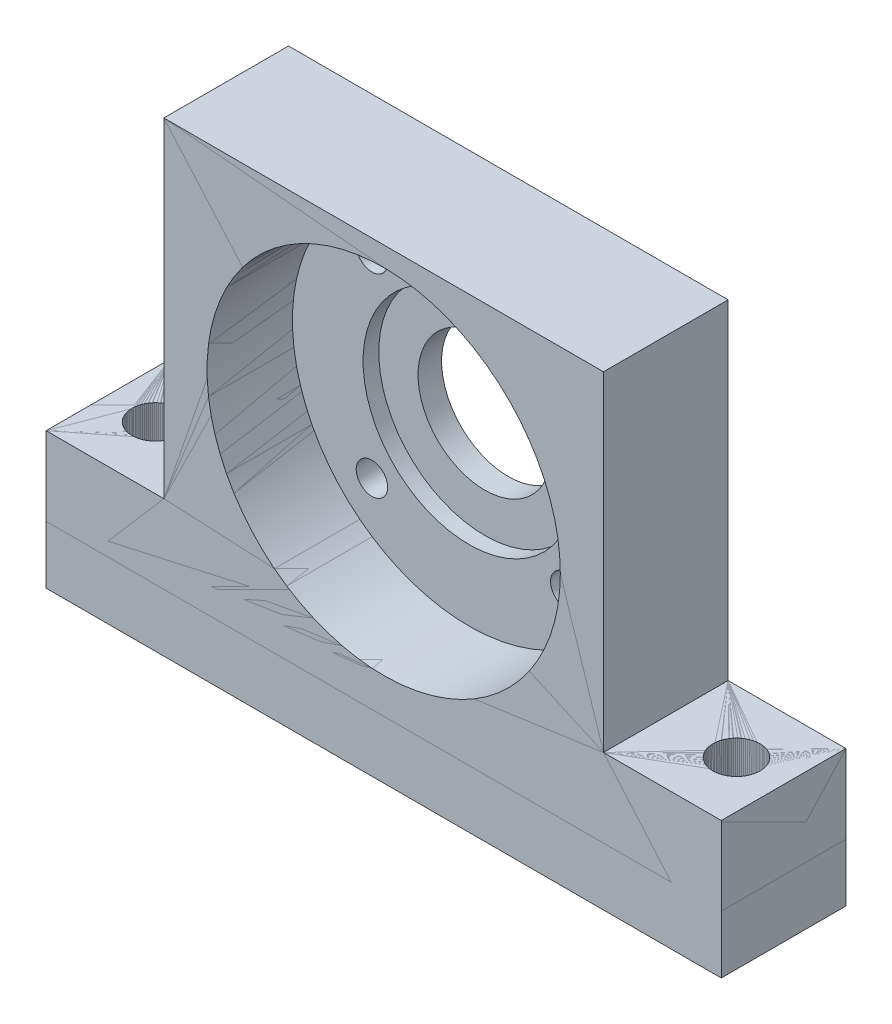
ISO-10303-21;
HEADER;
FILE_DESCRIPTION(('STEP AP214'),'2;1');
FILE_NAME('part.step','',(''),(''),'','','');
FILE_SCHEMA(('AUTOMOTIVE_DESIGN { 1 0 10303 214 1 1 1 1 }'));
ENDSEC;
DATA;
#1=APPLICATION_CONTEXT('core data for automotive mechanical design processes');
#2=APPLICATION_PROTOCOL_DEFINITION('international standard','automotive_design',2000,#1);
#3=PRODUCT_CONTEXT('',#1,'mechanical');
#4=PRODUCT('Part','Part','',(#3));
#5=PRODUCT_RELATED_PRODUCT_CATEGORY('part','',(#4));
#6=PRODUCT_DEFINITION_FORMATION('','',#4);
#7=PRODUCT_DEFINITION_CONTEXT('part definition',#1,'design');
#8=PRODUCT_DEFINITION('design','',#6,#7);
#9=PRODUCT_DEFINITION_SHAPE('','',#8);
#10=(LENGTH_UNIT() NAMED_UNIT(*) SI_UNIT(.MILLI.,.METRE.));
#11=(NAMED_UNIT(*) PLANE_ANGLE_UNIT() SI_UNIT($,.RADIAN.));
#12=(NAMED_UNIT(*) SI_UNIT($,.STERADIAN.) SOLID_ANGLE_UNIT());
#13=UNCERTAINTY_MEASURE_WITH_UNIT(LENGTH_MEASURE(1.E-05),#10,'distance_accuracy_value','');
#14=(GEOMETRIC_REPRESENTATION_CONTEXT(3) GLOBAL_UNCERTAINTY_ASSIGNED_CONTEXT((#13)) GLOBAL_UNIT_ASSIGNED_CONTEXT((#10,
#11,#12)) REPRESENTATION_CONTEXT('',''));
#15=CARTESIAN_POINT('',(0.,0.,0.));
#16=DIRECTION('',(0.,0.,1.));
#17=DIRECTION('',(1.,0.,0.));
#18=AXIS2_PLACEMENT_3D('',#15,#16,#17);
#19=CARTESIAN_POINT('',(0.,-5.56521739130435,0.));
#20=DIRECTION('',(0.,0.,1.));
#21=DIRECTION('',(1.,0.,0.));
#22=AXIS2_PLACEMENT_3D('',#19,#20,#21);
#23=PLANE('',#22);
#24=CARTESIAN_POINT('',(0.,0.,0.));
#25=DIRECTION('',(0.,0.,1.));
#26=DIRECTION('',(1.,0.,0.));
#27=AXIS2_PLACEMENT_3D('',#24,#25,#26);
#28=CIRCLE('',#27,22.5);
#29=CARTESIAN_POINT('',(22.5,0.,0.));
#30=VERTEX_POINT('',#29);
#31=EDGE_CURVE('P0_E173',#30,#30,#28,.T.);
#32=ORIENTED_EDGE('',*,*,#31,.T.);
#33=EDGE_LOOP('',(#32));
#34=FACE_BOUND('',#33,.T.);
#35=DIRECTION('',(0.,-1.,0.));
#36=VECTOR('',#35,1.);
#37=CARTESIAN_POINT('',(-28.,0.,0.));
#38=LINE('',#37,#36);
#39=CARTESIAN_POINT('',(-28.,25.,0.));
#40=VERTEX_POINT('',#39);
#41=CARTESIAN_POINT('',(-28.,-17.,0.));
#42=VERTEX_POINT('',#41);
#43=EDGE_CURVE('P0_E56',#40,#42,#38,.T.);
#44=ORIENTED_EDGE('',*,*,#43,.F.);
#45=DIRECTION('',(-1.,0.,0.));
#46=VECTOR('',#45,1.);
#47=CARTESIAN_POINT('',(28.,25.,0.));
#48=LINE('',#47,#46);
#49=CARTESIAN_POINT('',(28.,25.,0.));
#50=VERTEX_POINT('',#49);
#51=EDGE_CURVE('P0_E212',#50,#40,#48,.T.);
#52=ORIENTED_EDGE('',*,*,#51,.F.);
#53=DIRECTION('',(0.,1.,0.));
#54=VECTOR('',#53,1.);
#55=CARTESIAN_POINT('',(28.,-17.,0.));
#56=LINE('',#55,#54);
#57=CARTESIAN_POINT('',(28.,-17.,0.));
#58=VERTEX_POINT('',#57);
#59=EDGE_CURVE('P0_E208',#58,#50,#56,.T.);
#60=ORIENTED_EDGE('',*,*,#59,.F.);
#61=DIRECTION('',(-1.,0.,0.));
#62=VECTOR('',#61,1.);
#63=CARTESIAN_POINT('',(43.,-17.,0.));
#64=LINE('',#63,#62);
#65=CARTESIAN_POINT('',(43.,-17.,0.));
#66=VERTEX_POINT('',#65);
#67=EDGE_CURVE('P0_E182',#66,#58,#64,.T.);
#68=ORIENTED_EDGE('',*,*,#67,.F.);
#69=DIRECTION('',(0.,1.,0.));
#70=VECTOR('',#69,1.);
#71=CARTESIAN_POINT('',(43.,-27.,0.));
#72=LINE('',#71,#70);
#73=CARTESIAN_POINT('',(43.,-34.375,0.));
#74=VERTEX_POINT('',#73);
#75=EDGE_CURVE('P0_E149',#74,#66,#72,.T.);
#76=ORIENTED_EDGE('',*,*,#75,.F.);
#77=DIRECTION('',(1.,0.,0.));
#78=VECTOR('',#77,1.);
#79=CARTESIAN_POINT('',(-43.,-34.375,0.));
#80=LINE('',#79,#78);
#81=CARTESIAN_POINT('',(-43.,-34.375,0.));
#82=VERTEX_POINT('',#81);
#83=EDGE_CURVE('P0_E147',#82,#74,#80,.T.);
#84=ORIENTED_EDGE('',*,*,#83,.F.);
#85=DIRECTION('',(0.,-1.,0.));
#86=VECTOR('',#85,1.);
#87=CARTESIAN_POINT('',(-43.,-17.,0.));
#88=LINE('',#87,#86);
#89=CARTESIAN_POINT('',(-43.,-17.,0.));
#90=VERTEX_POINT('',#89);
#91=EDGE_CURVE('P0_E135',#90,#82,#88,.T.);
#92=ORIENTED_EDGE('',*,*,#91,.F.);
#93=DIRECTION('',(-1.,0.,0.));
#94=VECTOR('',#93,1.);
#95=CARTESIAN_POINT('',(-28.,-17.,0.));
#96=LINE('',#95,#94);
#97=EDGE_CURVE('P0_E95',#42,#90,#96,.T.);
#98=ORIENTED_EDGE('',*,*,#97,.F.);
#99=EDGE_LOOP('',(#44,#52,#60,#68,#76,#84,#92,#98));
#100=FACE_BOUND('',#99,.T.);
#101=ADVANCED_FACE('P0_F45',(#34,#100),#23,.F.);
#102=CARTESIAN_POINT('',(0.,-5.56521739130435,15.875));
#103=DIRECTION('',(0.,0.,1.));
#104=DIRECTION('',(1.,0.,0.));
#105=AXIS2_PLACEMENT_3D('',#102,#103,#104);
#106=PLANE('',#105);
#107=DIRECTION('',(0.,-1.,0.));
#108=VECTOR('',#107,1.);
#109=CARTESIAN_POINT('',(-28.,25.,15.875));
#110=LINE('',#109,#108);
#111=CARTESIAN_POINT('',(-28.,25.,15.875));
#112=VERTEX_POINT('',#111);
#113=CARTESIAN_POINT('',(-28.,-17.,15.875));
#114=VERTEX_POINT('',#113);
#115=EDGE_CURVE('P0_E11',#112,#114,#110,.T.);
#116=ORIENTED_EDGE('',*,*,#115,.T.);
#117=DIRECTION('',(-1.,0.,0.));
#118=VECTOR('',#117,1.);
#119=CARTESIAN_POINT('',(-28.,-17.,15.875));
#120=LINE('',#119,#118);
#121=CARTESIAN_POINT('',(-43.,-17.,15.875));
#122=VERTEX_POINT('',#121);
#123=EDGE_CURVE('P0_E189',#114,#122,#120,.T.);
#124=ORIENTED_EDGE('',*,*,#123,.T.);
#125=DIRECTION('',(0.,-1.,0.));
#126=VECTOR('',#125,1.);
#127=CARTESIAN_POINT('',(-43.,-17.,15.875));
#128=LINE('',#127,#126);
#129=CARTESIAN_POINT('',(-43.,-34.375,15.875));
#130=VERTEX_POINT('',#129);
#131=EDGE_CURVE('P0_E144',#122,#130,#128,.T.);
#132=ORIENTED_EDGE('',*,*,#131,.T.);
#133=DIRECTION('',(-1.,0.,0.));
#134=VECTOR('',#133,1.);
#135=CARTESIAN_POINT('',(43.,-34.375,15.875));
#136=LINE('',#135,#134);
#137=CARTESIAN_POINT('',(43.,-34.375,15.875));
#138=VERTEX_POINT('',#137);
#139=EDGE_CURVE('P0_E159',#138,#130,#136,.T.);
#140=ORIENTED_EDGE('',*,*,#139,.F.);
#141=DIRECTION('',(0.,1.,0.));
#142=VECTOR('',#141,1.);
#143=CARTESIAN_POINT('',(43.,-27.,15.875));
#144=LINE('',#143,#142);
#145=CARTESIAN_POINT('',(43.,-17.,15.875));
#146=VERTEX_POINT('',#145);
#147=EDGE_CURVE('P0_E101',#138,#146,#144,.T.);
#148=ORIENTED_EDGE('',*,*,#147,.T.);
#149=DIRECTION('',(-1.,0.,0.));
#150=VECTOR('',#149,1.);
#151=CARTESIAN_POINT('',(43.,-17.,15.875));
#152=LINE('',#151,#150);
#153=CARTESIAN_POINT('',(28.,-17.,15.875));
#154=VERTEX_POINT('',#153);
#155=EDGE_CURVE('P0_E185',#146,#154,#152,.T.);
#156=ORIENTED_EDGE('',*,*,#155,.T.);
#157=DIRECTION('',(0.,1.,0.));
#158=VECTOR('',#157,1.);
#159=CARTESIAN_POINT('',(28.,-17.,15.875));
#160=LINE('',#159,#158);
#161=CARTESIAN_POINT('',(28.,25.,15.875));
#162=VERTEX_POINT('',#161);
#163=EDGE_CURVE('P0_E215',#154,#162,#160,.T.);
#164=ORIENTED_EDGE('',*,*,#163,.T.);
#165=DIRECTION('',(-1.,0.,0.));
#166=VECTOR('',#165,1.);
#167=CARTESIAN_POINT('',(28.,25.,15.875));
#168=LINE('',#167,#166);
#169=EDGE_CURVE('P0_E200',#162,#112,#168,.T.);
#170=ORIENTED_EDGE('',*,*,#169,.T.);
#171=EDGE_LOOP('',(#116,#124,#132,#140,#148,#156,#164,#170));
#172=FACE_BOUND('',#171,.T.);
#173=CARTESIAN_POINT('',(0.,0.,15.875));
#174=DIRECTION('',(0.,0.,1.));
#175=DIRECTION('',(1.,0.,0.));
#176=AXIS2_PLACEMENT_3D('',#173,#174,#175);
#177=CIRCLE('',#176,22.5);
#178=CARTESIAN_POINT('',(22.5,0.,15.875));
#179=VERTEX_POINT('',#178);
#180=EDGE_CURVE('P0_E177',#179,#179,#177,.T.);
#181=ORIENTED_EDGE('',*,*,#180,.F.);
#182=EDGE_LOOP('',(#181));
#183=FACE_BOUND('',#182,.T.);
#184=ADVANCED_FACE('P0_F258',(#172,#183),#106,.T.);
#185=CARTESIAN_POINT('',(-28.,0.,0.));
#186=DIRECTION('',(-1.,0.,0.));
#187=DIRECTION('',(0.,0.,1.));
#188=AXIS2_PLACEMENT_3D('',#185,#186,#187);
#189=PLANE('',#188);
#190=ORIENTED_EDGE('',*,*,#43,.T.);
#191=DIRECTION('',(0.,0.,1.));
#192=VECTOR('',#191,1.);
#193=CARTESIAN_POINT('',(-28.,-17.,0.));
#194=LINE('',#193,#192);
#195=EDGE_CURVE('P0_E192',#42,#114,#194,.T.);
#196=ORIENTED_EDGE('',*,*,#195,.T.);
#197=ORIENTED_EDGE('',*,*,#115,.F.);
#198=DIRECTION('',(0.,0.,1.));
#199=VECTOR('',#198,1.);
#200=CARTESIAN_POINT('',(-28.,25.,0.));
#201=LINE('',#200,#199);
#202=EDGE_CURVE('P0_E204',#40,#112,#201,.T.);
#203=ORIENTED_EDGE('',*,*,#202,.F.);
#204=EDGE_LOOP('',(#190,#196,#197,#203));
#205=FACE_BOUND('',#204,.T.);
#206=ADVANCED_FACE('P0_F256',(#205),#189,.T.);
#207=CARTESIAN_POINT('',(-28.,-17.,0.));
#208=DIRECTION('',(0.,1.,0.));
#209=DIRECTION('',(1.,0.,0.));
#210=AXIS2_PLACEMENT_3D('',#207,#208,#209);
#211=PLANE('',#210);
#212=CARTESIAN_POINT('',(-37.,-17.,7.9375));
#213=DIRECTION('',(0.,-1.,0.));
#214=DIRECTION('',(-1.,0.,0.));
#215=AXIS2_PLACEMENT_3D('',#212,#213,#214);
#216=CIRCLE('',#215,3.);
#217=CARTESIAN_POINT('',(-34.,-17.,7.9375));
#218=VERTEX_POINT('',#217);
#219=EDGE_CURVE('P0_E218',#218,#218,#216,.T.);
#220=ORIENTED_EDGE('',*,*,#219,.T.);
#221=EDGE_LOOP('',(#220));
#222=FACE_BOUND('',#221,.T.);
#223=ORIENTED_EDGE('',*,*,#97,.T.);
#224=DIRECTION('',(0.,0.,1.));
#225=VECTOR('',#224,1.);
#226=CARTESIAN_POINT('',(-43.,-17.,0.));
#227=LINE('',#226,#225);
#228=EDGE_CURVE('P0_E141',#90,#122,#227,.T.);
#229=ORIENTED_EDGE('',*,*,#228,.T.);
#230=ORIENTED_EDGE('',*,*,#123,.F.);
#231=ORIENTED_EDGE('',*,*,#195,.F.);
#232=EDGE_LOOP('',(#223,#229,#230,#231));
#233=FACE_BOUND('',#232,.T.);
#234=ADVANCED_FACE('P0_F265',(#222,#233),#211,.T.);
#235=CARTESIAN_POINT('',(-43.,-17.,0.));
#236=DIRECTION('',(-1.,0.,0.));
#237=DIRECTION('',(0.,0.,1.));
#238=AXIS2_PLACEMENT_3D('',#235,#236,#237);
#239=PLANE('',#238);
#240=ORIENTED_EDGE('',*,*,#91,.T.);
#241=DIRECTION('',(0.,0.,-1.));
#242=VECTOR('',#241,1.);
#243=CARTESIAN_POINT('',(-43.,-34.375,15.875));
#244=LINE('',#243,#242);
#245=EDGE_CURVE('P0_E140',#130,#82,#244,.T.);
#246=ORIENTED_EDGE('',*,*,#245,.F.);
#247=ORIENTED_EDGE('',*,*,#131,.F.);
#248=ORIENTED_EDGE('',*,*,#228,.F.);
#249=EDGE_LOOP('',(#240,#246,#247,#248));
#250=FACE_BOUND('',#249,.T.);
#251=ADVANCED_FACE('P0_F137',(#250),#239,.T.);
#252=CARTESIAN_POINT('',(43.,-27.,0.));
#253=DIRECTION('',(1.,0.,0.));
#254=DIRECTION('',(0.,1.,0.));
#255=AXIS2_PLACEMENT_3D('',#252,#253,#254);
#256=PLANE('',#255);
#257=ORIENTED_EDGE('',*,*,#75,.T.);
#258=DIRECTION('',(0.,0.,1.));
#259=VECTOR('',#258,1.);
#260=CARTESIAN_POINT('',(43.,-17.,0.));
#261=LINE('',#260,#259);
#262=EDGE_CURVE('P0_E195',#66,#146,#261,.T.);
#263=ORIENTED_EDGE('',*,*,#262,.T.);
#264=ORIENTED_EDGE('',*,*,#147,.F.);
#265=DIRECTION('',(0.,0.,1.));
#266=VECTOR('',#265,1.);
#267=CARTESIAN_POINT('',(43.,-34.375,0.));
#268=LINE('',#267,#266);
#269=EDGE_CURVE('P0_E154',#74,#138,#268,.T.);
#270=ORIENTED_EDGE('',*,*,#269,.F.);
#271=EDGE_LOOP('',(#257,#263,#264,#270));
#272=FACE_BOUND('',#271,.T.);
#273=ADVANCED_FACE('P0_F47',(#272),#256,.T.);
#274=CARTESIAN_POINT('',(43.,-17.,0.));
#275=DIRECTION('',(0.,1.,0.));
#276=DIRECTION('',(1.,0.,0.));
#277=AXIS2_PLACEMENT_3D('',#274,#275,#276);
#278=PLANE('',#277);
#279=CARTESIAN_POINT('',(37.,-17.,7.9375));
#280=DIRECTION('',(0.,-1.,0.));
#281=DIRECTION('',(-1.,0.,0.));
#282=AXIS2_PLACEMENT_3D('',#279,#280,#281);
#283=CIRCLE('',#282,3.);
#284=CARTESIAN_POINT('',(40.,-17.,7.9375));
#285=VERTEX_POINT('',#284);
#286=EDGE_CURVE('P0_E181',#285,#285,#283,.T.);
#287=ORIENTED_EDGE('',*,*,#286,.T.);
#288=EDGE_LOOP('',(#287));
#289=FACE_BOUND('',#288,.T.);
#290=ORIENTED_EDGE('',*,*,#67,.T.);
#291=DIRECTION('',(0.,0.,1.));
#292=VECTOR('',#291,1.);
#293=CARTESIAN_POINT('',(28.,-17.,0.));
#294=LINE('',#293,#292);
#295=EDGE_CURVE('P0_E186',#58,#154,#294,.T.);
#296=ORIENTED_EDGE('',*,*,#295,.T.);
#297=ORIENTED_EDGE('',*,*,#155,.F.);
#298=ORIENTED_EDGE('',*,*,#262,.F.);
#299=EDGE_LOOP('',(#290,#296,#297,#298));
#300=FACE_BOUND('',#299,.T.);
#301=ADVANCED_FACE('P0_F263',(#289,#300),#278,.T.);
#302=CARTESIAN_POINT('',(28.,-17.,0.));
#303=DIRECTION('',(1.,0.,0.));
#304=DIRECTION('',(0.,1.,0.));
#305=AXIS2_PLACEMENT_3D('',#302,#303,#304);
#306=PLANE('',#305);
#307=ORIENTED_EDGE('',*,*,#59,.T.);
#308=DIRECTION('',(0.,0.,1.));
#309=VECTOR('',#308,1.);
#310=CARTESIAN_POINT('',(28.,25.,0.));
#311=LINE('',#310,#309);
#312=EDGE_CURVE('P0_E203',#50,#162,#311,.T.);
#313=ORIENTED_EDGE('',*,*,#312,.T.);
#314=ORIENTED_EDGE('',*,*,#163,.F.);
#315=ORIENTED_EDGE('',*,*,#295,.F.);
#316=EDGE_LOOP('',(#307,#313,#314,#315));
#317=FACE_BOUND('',#316,.T.);
#318=ADVANCED_FACE('P0_F248',(#317),#306,.T.);
#319=CARTESIAN_POINT('',(28.,25.,0.));
#320=DIRECTION('',(0.,1.,0.));
#321=DIRECTION('',(1.,0.,0.));
#322=AXIS2_PLACEMENT_3D('',#319,#320,#321);
#323=PLANE('',#322);
#324=ORIENTED_EDGE('',*,*,#51,.T.);
#325=ORIENTED_EDGE('',*,*,#202,.T.);
#326=ORIENTED_EDGE('',*,*,#169,.F.);
#327=ORIENTED_EDGE('',*,*,#312,.F.);
#328=EDGE_LOOP('',(#324,#325,#326,#327));
#329=FACE_BOUND('',#328,.T.);
#330=ADVANCED_FACE('P0_F253',(#329),#323,.T.);
#331=CARTESIAN_POINT('',(-37.,-17.,7.9375));
#332=DIRECTION('',(0.,-1.,0.));
#333=DIRECTION('',(-1.,0.,0.));
#334=AXIS2_PLACEMENT_3D('',#331,#332,#333);
#335=CYLINDRICAL_SURFACE('',#334,3.);
#336=ORIENTED_EDGE('',*,*,#219,.F.);
#337=DIRECTION('',(0.,-1.,0.));
#338=VECTOR('',#337,1.);
#339=CARTESIAN_POINT('',(-34.,-17.,7.9375));
#340=LINE('',#339,#338);
#341=CARTESIAN_POINT('',(-34.,-27.,7.9375));
#342=VERTEX_POINT('',#341);
#343=EDGE_CURVE('P0_E120',#218,#342,#340,.T.);
#344=ORIENTED_EDGE('',*,*,#343,.T.);
#345=ORIENTED_EDGE('',*,*,#343,.F.);
#346=EDGE_LOOP('',(#336,#344,#345));
#347=FACE_BOUND('',#346,.T.);
#348=CARTESIAN_POINT('',(-37.,-34.375,7.9375));
#349=DIRECTION('',(0.,-1.,0.));
#350=DIRECTION('',(0.,0.,-1.));
#351=AXIS2_PLACEMENT_3D('',#348,#349,#350);
#352=CIRCLE('',#351,2.99999999999999);
#353=CARTESIAN_POINT('',(-37.,-34.375,4.93750000000001));
#354=VERTEX_POINT('',#353);
#355=EDGE_CURVE('P0_E165',#354,#354,#352,.T.);
#356=ORIENTED_EDGE('',*,*,#355,.T.);
#357=EDGE_LOOP('',(#356));
#358=FACE_BOUND('',#357,.T.);
#359=ADVANCED_FACE('P0_F289',(#347,#358),#335,.F.);
#360=CARTESIAN_POINT('',(37.,-17.,7.9375));
#361=DIRECTION('',(0.,-1.,0.));
#362=DIRECTION('',(-1.,0.,0.));
#363=AXIS2_PLACEMENT_3D('',#360,#361,#362);
#364=CYLINDRICAL_SURFACE('',#363,3.);
#365=ORIENTED_EDGE('',*,*,#286,.F.);
#366=DIRECTION('',(0.,-1.,0.));
#367=VECTOR('',#366,1.);
#368=CARTESIAN_POINT('',(40.,-17.,7.9375));
#369=LINE('',#368,#367);
#370=CARTESIAN_POINT('',(40.,-27.,7.9375));
#371=VERTEX_POINT('',#370);
#372=EDGE_CURVE('P0_E113',#285,#371,#369,.T.);
#373=ORIENTED_EDGE('',*,*,#372,.T.);
#374=ORIENTED_EDGE('',*,*,#372,.F.);
#375=EDGE_LOOP('',(#365,#373,#374));
#376=FACE_BOUND('',#375,.T.);
#377=CARTESIAN_POINT('',(37.,-34.375,7.9375));
#378=DIRECTION('',(0.,-1.,0.));
#379=DIRECTION('',(0.,0.,-1.));
#380=AXIS2_PLACEMENT_3D('',#377,#378,#379);
#381=CIRCLE('',#380,3.);
#382=CARTESIAN_POINT('',(37.,-34.375,4.9375));
#383=VERTEX_POINT('',#382);
#384=EDGE_CURVE('P0_E161',#383,#383,#381,.T.);
#385=ORIENTED_EDGE('',*,*,#384,.T.);
#386=EDGE_LOOP('',(#385));
#387=FACE_BOUND('',#386,.T.);
#388=ADVANCED_FACE('P0_F286',(#376,#387),#364,.F.);
#389=CARTESIAN_POINT('',(0.,0.,0.));
#390=DIRECTION('',(0.,0.,1.));
#391=DIRECTION('',(1.,0.,0.));
#392=AXIS2_PLACEMENT_3D('',#389,#390,#391);
#393=CYLINDRICAL_SURFACE('',#392,22.5);
#394=ORIENTED_EDGE('',*,*,#180,.T.);
#395=EDGE_LOOP('',(#394));
#396=FACE_BOUND('',#395,.T.);
#397=ORIENTED_EDGE('',*,*,#31,.F.);
#398=EDGE_LOOP('',(#397));
#399=FACE_BOUND('',#398,.T.);
#400=ADVANCED_FACE('P0_F288',(#396,#399),#393,.F.);
#401=CARTESIAN_POINT('',(0.,-34.375,0.));
#402=DIRECTION('',(0.,-1.,0.));
#403=DIRECTION('',(0.,0.,-1.));
#404=AXIS2_PLACEMENT_3D('',#401,#402,#403);
#405=PLANE('',#404);
#406=ORIENTED_EDGE('',*,*,#384,.F.);
#407=EDGE_LOOP('',(#406));
#408=FACE_BOUND('',#407,.T.);
#409=ORIENTED_EDGE('',*,*,#245,.T.);
#410=ORIENTED_EDGE('',*,*,#83,.T.);
#411=ORIENTED_EDGE('',*,*,#269,.T.);
#412=ORIENTED_EDGE('',*,*,#139,.T.);
#413=EDGE_LOOP('',(#409,#410,#411,#412));
#414=FACE_BOUND('',#413,.T.);
#415=ORIENTED_EDGE('',*,*,#355,.F.);
#416=EDGE_LOOP('',(#415));
#417=FACE_BOUND('',#416,.T.);
#418=ADVANCED_FACE('P0_F157',(#408,#414,#417),#405,.T.);
#419=CLOSED_SHELL('',(#101,#184,#206,#234,#251,#273,#301,#318,#330,#359,#388,#400,#418));
#420=MANIFOLD_SOLID_BREP('P0_B2',#419);
#421=CARTESIAN_POINT('',(0.,-5.56521739130435,0.));
#422=DIRECTION('',(0.,0.,1.));
#423=DIRECTION('',(1.,0.,0.));
#424=AXIS2_PLACEMENT_3D('',#421,#422,#423);
#425=PLANE('',#424);
#426=CARTESIAN_POINT('',(0.,0.,0.));
#427=DIRECTION('',(0.,0.,1.));
#428=DIRECTION('',(-1.,0.,0.));
#429=AXIS2_PLACEMENT_3D('',#426,#427,#428);
#430=CIRCLE('',#429,8.5);
#431=CARTESIAN_POINT('',(8.5,0.,0.));
#432=VERTEX_POINT('',#431);
#433=EDGE_CURVE('P1_E234',#432,#432,#430,.T.);
#434=ORIENTED_EDGE('',*,*,#433,.T.);
#435=EDGE_LOOP('',(#434));
#436=FACE_BOUND('',#435,.T.);
#437=CARTESIAN_POINT('',(12.3743686707646,12.3743686707646,0.));
#438=DIRECTION('',(0.,0.,1.));
#439=DIRECTION('',(-1.,0.,0.));
#440=AXIS2_PLACEMENT_3D('',#437,#438,#439);
#441=CIRCLE('',#440,2.);
#442=CARTESIAN_POINT('',(14.3743686707646,12.3743686707646,0.));
#443=VERTEX_POINT('',#442);
#444=EDGE_CURVE('P1_E285',#443,#443,#441,.T.);
#445=ORIENTED_EDGE('',*,*,#444,.T.);
#446=EDGE_LOOP('',(#445));
#447=FACE_BOUND('',#446,.T.);
#448=CARTESIAN_POINT('',(-12.3743686707646,-12.3743686707646,0.));
#449=DIRECTION('',(0.,0.,1.));
#450=DIRECTION('',(-1.,0.,0.));
#451=AXIS2_PLACEMENT_3D('',#448,#449,#450);
#452=CIRCLE('',#451,2.);
#453=CARTESIAN_POINT('',(-10.3743686707646,-12.3743686707646,0.));
#454=VERTEX_POINT('',#453);
#455=EDGE_CURVE('P1_E174',#454,#454,#452,.T.);
#456=ORIENTED_EDGE('',*,*,#455,.T.);
#457=EDGE_LOOP('',(#456));
#458=FACE_BOUND('',#457,.T.);
#459=CARTESIAN_POINT('',(-12.3743686707646,12.3743686707646,0.));
#460=DIRECTION('',(0.,0.,1.));
#461=DIRECTION('',(-1.,0.,0.));
#462=AXIS2_PLACEMENT_3D('',#459,#460,#461);
#463=CIRCLE('',#462,2.);
#464=CARTESIAN_POINT('',(-10.3743686707646,12.3743686707646,0.));
#465=VERTEX_POINT('',#464);
#466=EDGE_CURVE('P1_E176',#465,#465,#463,.T.);
#467=ORIENTED_EDGE('',*,*,#466,.T.);
#468=EDGE_LOOP('',(#467));
#469=FACE_BOUND('',#468,.T.);
#470=CARTESIAN_POINT('',(12.3743686707646,-12.3743686707646,0.));
#471=DIRECTION('',(0.,0.,1.));
#472=DIRECTION('',(-1.,0.,0.));
#473=AXIS2_PLACEMENT_3D('',#470,#471,#472);
#474=CIRCLE('',#473,2.);
#475=CARTESIAN_POINT('',(14.3743686707646,-12.3743686707646,0.));
#476=VERTEX_POINT('',#475);
#477=EDGE_CURVE('P1_E203',#476,#476,#474,.T.);
#478=ORIENTED_EDGE('',*,*,#477,.T.);
#479=EDGE_LOOP('',(#478));
#480=FACE_BOUND('',#479,.T.);
#481=DIRECTION('',(0.,-1.,0.));
#482=VECTOR('',#481,1.);
#483=CARTESIAN_POINT('',(-28.,0.,0.));
#484=LINE('',#483,#482);
#485=CARTESIAN_POINT('',(-28.,25.,0.));
#486=VERTEX_POINT('',#485);
#487=CARTESIAN_POINT('',(-28.,-17.,0.));
#488=VERTEX_POINT('',#487);
#489=EDGE_CURVE('P1_E27',#486,#488,#484,.T.);
#490=ORIENTED_EDGE('',*,*,#489,.F.);
#491=DIRECTION('',(-1.,0.,0.));
#492=VECTOR('',#491,1.);
#493=CARTESIAN_POINT('',(28.,25.,0.));
#494=LINE('',#493,#492);
#495=CARTESIAN_POINT('',(28.,25.,0.));
#496=VERTEX_POINT('',#495);
#497=EDGE_CURVE('P1_E215',#496,#486,#494,.T.);
#498=ORIENTED_EDGE('',*,*,#497,.F.);
#499=DIRECTION('',(0.,1.,0.));
#500=VECTOR('',#499,1.);
#501=CARTESIAN_POINT('',(28.,-17.,0.));
#502=LINE('',#501,#500);
#503=CARTESIAN_POINT('',(28.,-17.,0.));
#504=VERTEX_POINT('',#503);
#505=EDGE_CURVE('P1_E20',#504,#496,#502,.T.);
#506=ORIENTED_EDGE('',*,*,#505,.F.);
#507=DIRECTION('',(-1.,0.,0.));
#508=VECTOR('',#507,1.);
#509=CARTESIAN_POINT('',(43.,-17.,0.));
#510=LINE('',#509,#508);
#511=CARTESIAN_POINT('',(43.,-17.,0.));
#512=VERTEX_POINT('',#511);
#513=EDGE_CURVE('P1_E198',#512,#504,#510,.T.);
#514=ORIENTED_EDGE('',*,*,#513,.F.);
#515=DIRECTION('',(0.,1.,0.));
#516=VECTOR('',#515,1.);
#517=CARTESIAN_POINT('',(43.,-27.,0.));
#518=LINE('',#517,#516);
#519=CARTESIAN_POINT('',(43.,-27.,0.));
#520=VERTEX_POINT('',#519);
#521=EDGE_CURVE('P1_E257',#520,#512,#518,.T.);
#522=ORIENTED_EDGE('',*,*,#521,.F.);
#523=DIRECTION('',(1.,0.,0.));
#524=VECTOR('',#523,1.);
#525=CARTESIAN_POINT('',(-43.,-27.,0.));
#526=LINE('',#525,#524);
#527=CARTESIAN_POINT('',(-43.,-27.,0.));
#528=VERTEX_POINT('',#527);
#529=EDGE_CURVE('P1_E225',#528,#520,#526,.T.);
#530=ORIENTED_EDGE('',*,*,#529,.F.);
#531=DIRECTION('',(0.,-1.,0.));
#532=VECTOR('',#531,1.);
#533=CARTESIAN_POINT('',(-43.,-17.,0.));
#534=LINE('',#533,#532);
#535=CARTESIAN_POINT('',(-43.,-17.,0.));
#536=VERTEX_POINT('',#535);
#537=EDGE_CURVE('P1_E331',#536,#528,#534,.T.);
#538=ORIENTED_EDGE('',*,*,#537,.F.);
#539=DIRECTION('',(-1.,0.,0.));
#540=VECTOR('',#539,1.);
#541=CARTESIAN_POINT('',(-28.,-17.,0.));
#542=LINE('',#541,#540);
#543=EDGE_CURVE('P1_E319',#488,#536,#542,.T.);
#544=ORIENTED_EDGE('',*,*,#543,.F.);
#545=EDGE_LOOP('',(#490,#498,#506,#514,#522,#530,#538,#544));
#546=FACE_BOUND('',#545,.T.);
#547=ADVANCED_FACE('P1_F16',(#436,#447,#458,#469,#480,#546),#425,.F.);
#548=CARTESIAN_POINT('',(0.,-5.56521739130435,15.875));
#549=DIRECTION('',(0.,0.,1.));
#550=DIRECTION('',(1.,0.,0.));
#551=AXIS2_PLACEMENT_3D('',#548,#549,#550);
#552=PLANE('',#551);
#553=CARTESIAN_POINT('',(0.,0.,15.875));
#554=DIRECTION('',(0.,0.,-1.));
#555=DIRECTION('',(-1.,0.,0.));
#556=AXIS2_PLACEMENT_3D('',#553,#554,#555);
#557=CIRCLE('',#556,22.5);
#558=CARTESIAN_POINT('',(22.5,0.,15.875));
#559=VERTEX_POINT('',#558);
#560=EDGE_CURVE('P1_E281',#559,#559,#557,.T.);
#561=ORIENTED_EDGE('',*,*,#560,.T.);
#562=EDGE_LOOP('',(#561));
#563=FACE_BOUND('',#562,.T.);
#564=DIRECTION('',(0.,-1.,0.));
#565=VECTOR('',#564,1.);
#566=CARTESIAN_POINT('',(-28.,25.,15.875));
#567=LINE('',#566,#565);
#568=CARTESIAN_POINT('',(-28.,25.,15.875));
#569=VERTEX_POINT('',#568);
#570=CARTESIAN_POINT('',(-28.,-17.,15.875));
#571=VERTEX_POINT('',#570);
#572=EDGE_CURVE('P1_E11',#569,#571,#567,.T.);
#573=ORIENTED_EDGE('',*,*,#572,.T.);
#574=DIRECTION('',(-1.,0.,0.));
#575=VECTOR('',#574,1.);
#576=CARTESIAN_POINT('',(-28.,-17.,15.875));
#577=LINE('',#576,#575);
#578=CARTESIAN_POINT('',(-43.,-17.,15.875));
#579=VERTEX_POINT('',#578);
#580=EDGE_CURVE('P1_E288',#571,#579,#577,.T.);
#581=ORIENTED_EDGE('',*,*,#580,.T.);
#582=DIRECTION('',(0.,-1.,0.));
#583=VECTOR('',#582,1.);
#584=CARTESIAN_POINT('',(-43.,-17.,15.875));
#585=LINE('',#584,#583);
#586=CARTESIAN_POINT('',(-43.,-27.,15.875));
#587=VERTEX_POINT('',#586);
#588=EDGE_CURVE('P1_E320',#579,#587,#585,.T.);
#589=ORIENTED_EDGE('',*,*,#588,.T.);
#590=DIRECTION('',(1.,0.,0.));
#591=VECTOR('',#590,1.);
#592=CARTESIAN_POINT('',(-43.,-27.,15.875));
#593=LINE('',#592,#591);
#594=CARTESIAN_POINT('',(43.,-27.,15.875));
#595=VERTEX_POINT('',#594);
#596=EDGE_CURVE('P1_E244',#587,#595,#593,.T.);
#597=ORIENTED_EDGE('',*,*,#596,.T.);
#598=DIRECTION('',(0.,1.,0.));
#599=VECTOR('',#598,1.);
#600=CARTESIAN_POINT('',(43.,-27.,15.875));
#601=LINE('',#600,#599);
#602=CARTESIAN_POINT('',(43.,-17.,15.875));
#603=VERTEX_POINT('',#602);
#604=EDGE_CURVE('P1_E226',#595,#603,#601,.T.);
#605=ORIENTED_EDGE('',*,*,#604,.T.);
#606=DIRECTION('',(-1.,0.,0.));
#607=VECTOR('',#606,1.);
#608=CARTESIAN_POINT('',(43.,-17.,15.875));
#609=LINE('',#608,#607);
#610=CARTESIAN_POINT('',(28.,-17.,15.875));
#611=VERTEX_POINT('',#610);
#612=EDGE_CURVE('P1_E196',#603,#611,#609,.T.);
#613=ORIENTED_EDGE('',*,*,#612,.T.);
#614=DIRECTION('',(0.,1.,0.));
#615=VECTOR('',#614,1.);
#616=CARTESIAN_POINT('',(28.,-17.,15.875));
#617=LINE('',#616,#615);
#618=CARTESIAN_POINT('',(28.,25.,15.875));
#619=VERTEX_POINT('',#618);
#620=EDGE_CURVE('P1_E275',#611,#619,#617,.T.);
#621=ORIENTED_EDGE('',*,*,#620,.T.);
#622=DIRECTION('',(-1.,0.,0.));
#623=VECTOR('',#622,1.);
#624=CARTESIAN_POINT('',(28.,25.,15.875));
#625=LINE('',#624,#623);
#626=EDGE_CURVE('P1_E292',#619,#569,#625,.T.);
#627=ORIENTED_EDGE('',*,*,#626,.T.);
#628=EDGE_LOOP('',(#573,#581,#589,#597,#605,#613,#621,#627));
#629=FACE_BOUND('',#628,.T.);
#630=ADVANCED_FACE('P1_F486',(#563,#629),#552,.T.);
#631=CARTESIAN_POINT('',(-28.,0.,0.));
#632=DIRECTION('',(-1.,0.,0.));
#633=DIRECTION('',(0.,0.,1.));
#634=AXIS2_PLACEMENT_3D('',#631,#632,#633);
#635=PLANE('',#634);
#636=ORIENTED_EDGE('',*,*,#489,.T.);
#637=DIRECTION('',(0.,0.,1.));
#638=VECTOR('',#637,1.);
#639=CARTESIAN_POINT('',(-28.,-17.,0.));
#640=LINE('',#639,#638);
#641=EDGE_CURVE('P1_E243',#488,#571,#640,.T.);
#642=ORIENTED_EDGE('',*,*,#641,.T.);
#643=ORIENTED_EDGE('',*,*,#572,.F.);
#644=DIRECTION('',(0.,0.,1.));
#645=VECTOR('',#644,1.);
#646=CARTESIAN_POINT('',(-28.,25.,0.));
#647=LINE('',#646,#645);
#648=EDGE_CURVE('P1_E219',#486,#569,#647,.T.);
#649=ORIENTED_EDGE('',*,*,#648,.F.);
#650=EDGE_LOOP('',(#636,#642,#643,#649));
#651=FACE_BOUND('',#650,.T.);
#652=ADVANCED_FACE('P1_F439',(#651),#635,.T.);
#653=CARTESIAN_POINT('',(-28.,-17.,0.));
#654=DIRECTION('',(0.,1.,0.));
#655=DIRECTION('',(1.,0.,0.));
#656=AXIS2_PLACEMENT_3D('',#653,#654,#655);
#657=PLANE('',#656);
#658=CARTESIAN_POINT('',(-37.,-17.,7.9375));
#659=DIRECTION('',(0.,-1.,0.));
#660=DIRECTION('',(-1.,0.,0.));
#661=AXIS2_PLACEMENT_3D('',#658,#659,#660);
#662=CIRCLE('',#661,3.);
#663=CARTESIAN_POINT('',(-34.,-17.,7.9375));
#664=VERTEX_POINT('',#663);
#665=EDGE_CURVE('P1_E276',#664,#664,#662,.T.);
#666=ORIENTED_EDGE('',*,*,#665,.T.);
#667=EDGE_LOOP('',(#666));
#668=FACE_BOUND('',#667,.T.);
#669=ORIENTED_EDGE('',*,*,#543,.T.);
#670=DIRECTION('',(0.,0.,1.));
#671=VECTOR('',#670,1.);
#672=CARTESIAN_POINT('',(-43.,-17.,0.));
#673=LINE('',#672,#671);
#674=EDGE_CURVE('P1_E315',#536,#579,#673,.T.);
#675=ORIENTED_EDGE('',*,*,#674,.T.);
#676=ORIENTED_EDGE('',*,*,#580,.F.);
#677=ORIENTED_EDGE('',*,*,#641,.F.);
#678=EDGE_LOOP('',(#669,#675,#676,#677));
#679=FACE_BOUND('',#678,.T.);
#680=ADVANCED_FACE('P1_F383',(#668,#679),#657,.T.);
#681=CARTESIAN_POINT('',(-43.,-17.,0.));
#682=DIRECTION('',(-1.,0.,0.));
#683=DIRECTION('',(0.,0.,1.));
#684=AXIS2_PLACEMENT_3D('',#681,#682,#683);
#685=PLANE('',#684);
#686=ORIENTED_EDGE('',*,*,#537,.T.);
#687=DIRECTION('',(0.,0.,1.));
#688=VECTOR('',#687,1.);
#689=CARTESIAN_POINT('',(-43.,-27.,0.));
#690=LINE('',#689,#688);
#691=EDGE_CURVE('P1_E247',#528,#587,#690,.T.);
#692=ORIENTED_EDGE('',*,*,#691,.T.);
#693=ORIENTED_EDGE('',*,*,#588,.F.);
#694=ORIENTED_EDGE('',*,*,#674,.F.);
#695=EDGE_LOOP('',(#686,#692,#693,#694));
#696=FACE_BOUND('',#695,.T.);
#697=ADVANCED_FACE('P1_F377',(#696),#685,.T.);
#698=CARTESIAN_POINT('',(-43.,-27.,0.));
#699=DIRECTION('',(0.,-1.,0.));
#700=DIRECTION('',(0.,0.,-1.));
#701=AXIS2_PLACEMENT_3D('',#698,#699,#700);
#702=PLANE('',#701);
#703=CARTESIAN_POINT('',(-37.,-27.,7.9375));
#704=DIRECTION('',(0.,1.,0.));
#705=DIRECTION('',(-1.,0.,0.));
#706=AXIS2_PLACEMENT_3D('',#703,#704,#705);
#707=CIRCLE('',#706,3.);
#708=CARTESIAN_POINT('',(-34.,-27.,7.9375));
#709=VERTEX_POINT('',#708);
#710=EDGE_CURVE('P1_E133',#709,#709,#707,.T.);
#711=ORIENTED_EDGE('',*,*,#710,.T.);
#712=EDGE_LOOP('',(#711));
#713=FACE_BOUND('',#712,.T.);
#714=CARTESIAN_POINT('',(37.,-27.,7.9375));
#715=DIRECTION('',(0.,1.,0.));
#716=DIRECTION('',(-1.,0.,0.));
#717=AXIS2_PLACEMENT_3D('',#714,#715,#716);
#718=CIRCLE('',#717,3.);
#719=CARTESIAN_POINT('',(40.,-27.,7.9375));
#720=VERTEX_POINT('',#719);
#721=EDGE_CURVE('P1_E230',#720,#720,#718,.T.);
#722=ORIENTED_EDGE('',*,*,#721,.T.);
#723=EDGE_LOOP('',(#722));
#724=FACE_BOUND('',#723,.T.);
#725=ORIENTED_EDGE('',*,*,#529,.T.);
#726=DIRECTION('',(0.,0.,1.));
#727=VECTOR('',#726,1.);
#728=CARTESIAN_POINT('',(43.,-27.,0.));
#729=LINE('',#728,#727);
#730=EDGE_CURVE('P1_E221',#520,#595,#729,.T.);
#731=ORIENTED_EDGE('',*,*,#730,.T.);
#732=ORIENTED_EDGE('',*,*,#596,.F.);
#733=ORIENTED_EDGE('',*,*,#691,.F.);
#734=EDGE_LOOP('',(#725,#731,#732,#733));
#735=FACE_BOUND('',#734,.T.);
#736=ADVANCED_FACE('P1_F382',(#713,#724,#735),#702,.T.);
#737=CARTESIAN_POINT('',(43.,-27.,0.));
#738=DIRECTION('',(1.,0.,0.));
#739=DIRECTION('',(0.,1.,0.));
#740=AXIS2_PLACEMENT_3D('',#737,#738,#739);
#741=PLANE('',#740);
#742=ORIENTED_EDGE('',*,*,#521,.T.);
#743=DIRECTION('',(0.,0.,1.));
#744=VECTOR('',#743,1.);
#745=CARTESIAN_POINT('',(43.,-17.,0.));
#746=LINE('',#745,#744);
#747=EDGE_CURVE('P1_E197',#512,#603,#746,.T.);
#748=ORIENTED_EDGE('',*,*,#747,.T.);
#749=ORIENTED_EDGE('',*,*,#604,.F.);
#750=ORIENTED_EDGE('',*,*,#730,.F.);
#751=EDGE_LOOP('',(#742,#748,#749,#750));
#752=FACE_BOUND('',#751,.T.);
#753=ADVANCED_FACE('P1_F468',(#752),#741,.T.);
#754=CARTESIAN_POINT('',(43.,-17.,0.));
#755=DIRECTION('',(0.,1.,0.));
#756=DIRECTION('',(1.,0.,0.));
#757=AXIS2_PLACEMENT_3D('',#754,#755,#756);
#758=PLANE('',#757);
#759=CARTESIAN_POINT('',(37.,-17.,7.9375));
#760=DIRECTION('',(0.,-1.,0.));
#761=DIRECTION('',(-1.,0.,0.));
#762=AXIS2_PLACEMENT_3D('',#759,#760,#761);
#763=CIRCLE('',#762,3.);
#764=CARTESIAN_POINT('',(40.,-17.,7.9375));
#765=VERTEX_POINT('',#764);
#766=EDGE_CURVE('P1_E210',#765,#765,#763,.T.);
#767=ORIENTED_EDGE('',*,*,#766,.T.);
#768=EDGE_LOOP('',(#767));
#769=FACE_BOUND('',#768,.T.);
#770=ORIENTED_EDGE('',*,*,#513,.T.);
#771=DIRECTION('',(0.,0.,1.));
#772=VECTOR('',#771,1.);
#773=CARTESIAN_POINT('',(28.,-17.,0.));
#774=LINE('',#773,#772);
#775=EDGE_CURVE('P1_E271',#504,#611,#774,.T.);
#776=ORIENTED_EDGE('',*,*,#775,.T.);
#777=ORIENTED_EDGE('',*,*,#612,.F.);
#778=ORIENTED_EDGE('',*,*,#747,.F.);
#779=EDGE_LOOP('',(#770,#776,#777,#778));
#780=FACE_BOUND('',#779,.T.);
#781=ADVANCED_FACE('P1_F350',(#769,#780),#758,.T.);
#782=CARTESIAN_POINT('',(28.,-17.,0.));
#783=DIRECTION('',(1.,0.,0.));
#784=DIRECTION('',(0.,1.,0.));
#785=AXIS2_PLACEMENT_3D('',#782,#783,#784);
#786=PLANE('',#785);
#787=ORIENTED_EDGE('',*,*,#505,.T.);
#788=DIRECTION('',(0.,0.,1.));
#789=VECTOR('',#788,1.);
#790=CARTESIAN_POINT('',(28.,25.,0.));
#791=LINE('',#790,#789);
#792=EDGE_CURVE('P1_E307',#496,#619,#791,.T.);
#793=ORIENTED_EDGE('',*,*,#792,.T.);
#794=ORIENTED_EDGE('',*,*,#620,.F.);
#795=ORIENTED_EDGE('',*,*,#775,.F.);
#796=EDGE_LOOP('',(#787,#793,#794,#795));
#797=FACE_BOUND('',#796,.T.);
#798=ADVANCED_FACE('P1_F357',(#797),#786,.T.);
#799=CARTESIAN_POINT('',(28.,25.,0.));
#800=DIRECTION('',(0.,1.,0.));
#801=DIRECTION('',(1.,0.,0.));
#802=AXIS2_PLACEMENT_3D('',#799,#800,#801);
#803=PLANE('',#802);
#804=ORIENTED_EDGE('',*,*,#497,.T.);
#805=ORIENTED_EDGE('',*,*,#648,.T.);
#806=ORIENTED_EDGE('',*,*,#626,.F.);
#807=ORIENTED_EDGE('',*,*,#792,.F.);
#808=EDGE_LOOP('',(#804,#805,#806,#807));
#809=FACE_BOUND('',#808,.T.);
#810=ADVANCED_FACE('P1_F419',(#809),#803,.T.);
#811=CARTESIAN_POINT('',(0.,0.,0.));
#812=DIRECTION('',(0.,0.,1.));
#813=DIRECTION('',(-1.,0.,0.));
#814=AXIS2_PLACEMENT_3D('',#811,#812,#813);
#815=CYLINDRICAL_SURFACE('',#814,8.5);
#816=ORIENTED_EDGE('',*,*,#433,.F.);
#817=DIRECTION('',(0.,0.,1.));
#818=VECTOR('',#817,1.);
#819=CARTESIAN_POINT('',(8.5,0.,0.));
#820=LINE('',#819,#818);
#821=CARTESIAN_POINT('',(8.5,0.,3.));
#822=VERTEX_POINT('',#821);
#823=EDGE_CURVE('P1_E220',#432,#822,#820,.T.);
#824=ORIENTED_EDGE('',*,*,#823,.T.);
#825=CARTESIAN_POINT('',(0.,0.,3.));
#826=DIRECTION('',(0.,0.,1.));
#827=DIRECTION('',(-1.,0.,0.));
#828=AXIS2_PLACEMENT_3D('',#825,#826,#827);
#829=CIRCLE('',#828,8.5);
#830=EDGE_CURVE('P1_E238',#822,#822,#829,.T.);
#831=ORIENTED_EDGE('',*,*,#830,.T.);
#832=ORIENTED_EDGE('',*,*,#823,.F.);
#833=EDGE_LOOP('',(#816,#824,#831,#832));
#834=FACE_BOUND('',#833,.T.);
#835=ADVANCED_FACE('P1_F429',(#834),#815,.F.);
#836=CARTESIAN_POINT('',(0.,0.,3.));
#837=DIRECTION('',(0.,0.,1.));
#838=DIRECTION('',(1.,0.,0.));
#839=AXIS2_PLACEMENT_3D('',#836,#837,#838);
#840=PLANE('',#839);
#841=ORIENTED_EDGE('',*,*,#830,.F.);
#842=EDGE_LOOP('',(#841));
#843=FACE_BOUND('',#842,.T.);
#844=CARTESIAN_POINT('',(0.,0.,3.));
#845=DIRECTION('',(0.,0.,1.));
#846=DIRECTION('',(-1.,0.,0.));
#847=AXIS2_PLACEMENT_3D('',#844,#845,#846);
#848=CIRCLE('',#847,13.5);
#849=CARTESIAN_POINT('',(13.5,0.,3.));
#850=VERTEX_POINT('',#849);
#851=EDGE_CURVE('P1_E253',#850,#850,#848,.T.);
#852=ORIENTED_EDGE('',*,*,#851,.T.);
#853=EDGE_LOOP('',(#852));
#854=FACE_BOUND('',#853,.T.);
#855=ADVANCED_FACE('P1_F397',(#843,#854),#840,.T.);
#856=CARTESIAN_POINT('',(0.,0.,15.875));
#857=DIRECTION('',(0.,0.,-1.));
#858=DIRECTION('',(-1.,0.,0.));
#859=AXIS2_PLACEMENT_3D('',#856,#857,#858);
#860=CYLINDRICAL_SURFACE('',#859,22.5);
#861=ORIENTED_EDGE('',*,*,#560,.F.);
#862=DIRECTION('',(0.,0.,-1.));
#863=VECTOR('',#862,1.);
#864=CARTESIAN_POINT('',(22.5,0.,15.875));
#865=LINE('',#864,#863);
#866=CARTESIAN_POINT('',(22.5,0.,5.));
#867=VERTEX_POINT('',#866);
#868=EDGE_CURVE('P1_E267',#559,#867,#865,.T.);
#869=ORIENTED_EDGE('',*,*,#868,.T.);
#870=CARTESIAN_POINT('',(0.,0.,5.));
#871=DIRECTION('',(0.,0.,-1.));
#872=DIRECTION('',(-1.,0.,0.));
#873=AXIS2_PLACEMENT_3D('',#870,#871,#872);
#874=CIRCLE('',#873,22.5);
#875=EDGE_CURVE('P1_E193',#867,#867,#874,.T.);
#876=ORIENTED_EDGE('',*,*,#875,.T.);
#877=ORIENTED_EDGE('',*,*,#868,.F.);
#878=EDGE_LOOP('',(#861,#869,#876,#877));
#879=FACE_BOUND('',#878,.T.);
#880=ADVANCED_FACE('P1_F391',(#879),#860,.F.);
#881=CARTESIAN_POINT('',(12.3743686707646,12.3743686707646,3.));
#882=DIRECTION('',(0.,0.,-1.));
#883=DIRECTION('',(-1.,0.,0.));
#884=AXIS2_PLACEMENT_3D('',#881,#882,#883);
#885=CYLINDRICAL_SURFACE('',#884,2.);
#886=CARTESIAN_POINT('',(12.3743686707646,12.3743686707646,5.));
#887=DIRECTION('',(0.,0.,-1.));
#888=DIRECTION('',(-1.,0.,0.));
#889=AXIS2_PLACEMENT_3D('',#886,#887,#888);
#890=CIRCLE('',#889,2.);
#891=CARTESIAN_POINT('',(14.3743686707646,12.3743686707646,5.));
#892=VERTEX_POINT('',#891);
#893=EDGE_CURVE('P1_E183',#892,#892,#890,.T.);
#894=ORIENTED_EDGE('',*,*,#893,.F.);
#895=DIRECTION('',(0.,0.,-1.));
#896=VECTOR('',#895,1.);
#897=CARTESIAN_POINT('',(14.3743686707646,12.3743686707646,3.));
#898=LINE('',#897,#896);
#899=EDGE_CURVE('P1_E293',#892,#443,#898,.T.);
#900=ORIENTED_EDGE('',*,*,#899,.T.);
#901=ORIENTED_EDGE('',*,*,#444,.F.);
#902=ORIENTED_EDGE('',*,*,#899,.F.);
#903=EDGE_LOOP('',(#894,#900,#901,#902));
#904=FACE_BOUND('',#903,.T.);
#905=ADVANCED_FACE('P1_F396',(#904),#885,.F.);
#906=CARTESIAN_POINT('',(-12.3743686707646,-12.3743686707646,3.));
#907=DIRECTION('',(0.,0.,-1.));
#908=DIRECTION('',(-1.,0.,0.));
#909=AXIS2_PLACEMENT_3D('',#906,#907,#908);
#910=CYLINDRICAL_SURFACE('',#909,2.);
#911=CARTESIAN_POINT('',(-12.3743686707646,-12.3743686707646,5.));
#912=DIRECTION('',(0.,0.,-1.));
#913=DIRECTION('',(-1.,0.,0.));
#914=AXIS2_PLACEMENT_3D('',#911,#912,#913);
#915=CIRCLE('',#914,2.);
#916=CARTESIAN_POINT('',(-10.3743686707646,-12.3743686707646,5.));
#917=VERTEX_POINT('',#916);
#918=EDGE_CURVE('P1_E173',#917,#917,#915,.T.);
#919=ORIENTED_EDGE('',*,*,#918,.F.);
#920=DIRECTION('',(0.,0.,-1.));
#921=VECTOR('',#920,1.);
#922=CARTESIAN_POINT('',(-10.3743686707646,-12.3743686707646,3.));
#923=LINE('',#922,#921);
#924=EDGE_CURVE('P1_E170',#917,#454,#923,.T.);
#925=ORIENTED_EDGE('',*,*,#924,.T.);
#926=ORIENTED_EDGE('',*,*,#455,.F.);
#927=ORIENTED_EDGE('',*,*,#924,.F.);
#928=EDGE_LOOP('',(#919,#925,#926,#927));
#929=FACE_BOUND('',#928,.T.);
#930=ADVANCED_FACE('P1_F172',(#929),#910,.F.);
#931=CARTESIAN_POINT('',(-12.3743686707646,12.3743686707646,3.));
#932=DIRECTION('',(0.,0.,-1.));
#933=DIRECTION('',(-1.,0.,0.));
#934=AXIS2_PLACEMENT_3D('',#931,#932,#933);
#935=CYLINDRICAL_SURFACE('',#934,2.);
#936=CARTESIAN_POINT('',(-12.3743686707646,12.3743686707646,5.));
#937=DIRECTION('',(0.,0.,-1.));
#938=DIRECTION('',(-1.,0.,0.));
#939=AXIS2_PLACEMENT_3D('',#936,#937,#938);
#940=CIRCLE('',#939,2.);
#941=CARTESIAN_POINT('',(-10.3743686707646,12.3743686707646,5.));
#942=VERTEX_POINT('',#941);
#943=EDGE_CURVE('P1_E182',#942,#942,#940,.T.);
#944=ORIENTED_EDGE('',*,*,#943,.F.);
#945=DIRECTION('',(0.,0.,-1.));
#946=VECTOR('',#945,1.);
#947=CARTESIAN_POINT('',(-10.3743686707646,12.3743686707646,3.));
#948=LINE('',#947,#946);
#949=EDGE_CURVE('P1_E200',#942,#465,#948,.T.);
#950=ORIENTED_EDGE('',*,*,#949,.T.);
#951=ORIENTED_EDGE('',*,*,#466,.F.);
#952=ORIENTED_EDGE('',*,*,#949,.F.);
#953=EDGE_LOOP('',(#944,#950,#951,#952));
#954=FACE_BOUND('',#953,.T.);
#955=ADVANCED_FACE('P1_F409',(#954),#935,.F.);
#956=CARTESIAN_POINT('',(12.3743686707646,-12.3743686707646,3.));
#957=DIRECTION('',(0.,0.,-1.));
#958=DIRECTION('',(-1.,0.,0.));
#959=AXIS2_PLACEMENT_3D('',#956,#957,#958);
#960=CYLINDRICAL_SURFACE('',#959,2.);
#961=CARTESIAN_POINT('',(12.3743686707646,-12.3743686707646,5.));
#962=DIRECTION('',(0.,0.,-1.));
#963=DIRECTION('',(-1.,0.,0.));
#964=AXIS2_PLACEMENT_3D('',#961,#962,#963);
#965=CIRCLE('',#964,2.);
#966=CARTESIAN_POINT('',(14.3743686707646,-12.3743686707646,5.));
#967=VERTEX_POINT('',#966);
#968=EDGE_CURVE('P1_E189',#967,#967,#965,.T.);
#969=ORIENTED_EDGE('',*,*,#968,.F.);
#970=DIRECTION('',(0.,0.,-1.));
#971=VECTOR('',#970,1.);
#972=CARTESIAN_POINT('',(14.3743686707646,-12.3743686707646,3.));
#973=LINE('',#972,#971);
#974=EDGE_CURVE('P1_E233',#967,#476,#973,.T.);
#975=ORIENTED_EDGE('',*,*,#974,.T.);
#976=ORIENTED_EDGE('',*,*,#477,.F.);
#977=ORIENTED_EDGE('',*,*,#974,.F.);
#978=EDGE_LOOP('',(#969,#975,#976,#977));
#979=FACE_BOUND('',#978,.T.);
#980=ADVANCED_FACE('P1_F18',(#979),#960,.F.);
#981=CARTESIAN_POINT('',(-37.,-17.,7.9375));
#982=DIRECTION('',(0.,-1.,0.));
#983=DIRECTION('',(-1.,0.,0.));
#984=AXIS2_PLACEMENT_3D('',#981,#982,#983);
#985=CYLINDRICAL_SURFACE('',#984,3.);
#986=ORIENTED_EDGE('',*,*,#665,.F.);
#987=DIRECTION('',(0.,-1.,0.));
#988=VECTOR('',#987,1.);
#989=CARTESIAN_POINT('',(-34.,-17.,7.9375));
#990=LINE('',#989,#988);
#991=EDGE_CURVE('P1_E124',#664,#709,#990,.T.);
#992=ORIENTED_EDGE('',*,*,#991,.T.);
#993=ORIENTED_EDGE('',*,*,#710,.F.);
#994=ORIENTED_EDGE('',*,*,#991,.F.);
#995=EDGE_LOOP('',(#986,#992,#993,#994));
#996=FACE_BOUND('',#995,.T.);
#997=ADVANCED_FACE('P1_F364',(#996),#985,.F.);
#998=CARTESIAN_POINT('',(37.,-17.,7.9375));
#999=DIRECTION('',(0.,-1.,0.));
#1000=DIRECTION('',(-1.,0.,0.));
#1001=AXIS2_PLACEMENT_3D('',#998,#999,#1000);
#1002=CYLINDRICAL_SURFACE('',#1001,3.);
#1003=ORIENTED_EDGE('',*,*,#766,.F.);
#1004=DIRECTION('',(0.,-1.,0.));
#1005=VECTOR('',#1004,1.);
#1006=CARTESIAN_POINT('',(40.,-17.,7.9375));
#1007=LINE('',#1006,#1005);
#1008=EDGE_CURVE('P1_E214',#765,#720,#1007,.T.);
#1009=ORIENTED_EDGE('',*,*,#1008,.T.);
#1010=ORIENTED_EDGE('',*,*,#721,.F.);
#1011=ORIENTED_EDGE('',*,*,#1008,.F.);
#1012=EDGE_LOOP('',(#1003,#1009,#1010,#1011));
#1013=FACE_BOUND('',#1012,.T.);
#1014=ADVANCED_FACE('P1_F369',(#1013),#1002,.F.);
#1015=CARTESIAN_POINT('',(0.,0.,5.));
#1016=DIRECTION('',(0.,0.,1.));
#1017=DIRECTION('',(1.,0.,0.));
#1018=AXIS2_PLACEMENT_3D('',#1015,#1016,#1017);
#1019=PLANE('',#1018);
#1020=ORIENTED_EDGE('',*,*,#968,.T.);
#1021=EDGE_LOOP('',(#1020));
#1022=FACE_BOUND('',#1021,.T.);
#1023=ORIENTED_EDGE('',*,*,#943,.T.);
#1024=EDGE_LOOP('',(#1023));
#1025=FACE_BOUND('',#1024,.T.);
#1026=ORIENTED_EDGE('',*,*,#918,.T.);
#1027=EDGE_LOOP('',(#1026));
#1028=FACE_BOUND('',#1027,.T.);
#1029=ORIENTED_EDGE('',*,*,#893,.T.);
#1030=EDGE_LOOP('',(#1029));
#1031=FACE_BOUND('',#1030,.T.);
#1032=CARTESIAN_POINT('',(0.,0.,5.));
#1033=DIRECTION('',(0.,0.,-1.));
#1034=DIRECTION('',(-1.,0.,0.));
#1035=AXIS2_PLACEMENT_3D('',#1032,#1033,#1034);
#1036=CIRCLE('',#1035,13.5);
#1037=CARTESIAN_POINT('',(13.5,0.,5.));
#1038=VERTEX_POINT('',#1037);
#1039=EDGE_CURVE('P1_E205',#1038,#1038,#1036,.T.);
#1040=ORIENTED_EDGE('',*,*,#1039,.T.);
#1041=EDGE_LOOP('',(#1040));
#1042=FACE_BOUND('',#1041,.T.);
#1043=ORIENTED_EDGE('',*,*,#875,.F.);
#1044=EDGE_LOOP('',(#1043));
#1045=FACE_BOUND('',#1044,.T.);
#1046=ADVANCED_FACE('P1_F179',(#1022,#1025,#1028,#1031,#1042,#1045),#1019,.T.);
#1047=CARTESIAN_POINT('',(0.,0.,3.));
#1048=DIRECTION('',(0.,0.,1.));
#1049=DIRECTION('',(-1.,0.,0.));
#1050=AXIS2_PLACEMENT_3D('',#1047,#1048,#1049);
#1051=CYLINDRICAL_SURFACE('',#1050,13.5);
#1052=ORIENTED_EDGE('',*,*,#851,.F.);
#1053=DIRECTION('',(0.,0.,1.));
#1054=VECTOR('',#1053,1.);
#1055=CARTESIAN_POINT('',(13.5,0.,3.));
#1056=LINE('',#1055,#1054);
#1057=EDGE_CURVE('P1_E209',#850,#1038,#1056,.T.);
#1058=ORIENTED_EDGE('',*,*,#1057,.T.);
#1059=ORIENTED_EDGE('',*,*,#1039,.F.);
#1060=ORIENTED_EDGE('',*,*,#1057,.F.);
#1061=EDGE_LOOP('',(#1052,#1058,#1059,#1060));
#1062=FACE_BOUND('',#1061,.T.);
#1063=ADVANCED_FACE('P1_F446',(#1062),#1051,.F.);
#1064=CLOSED_SHELL('',(#547,#630,#652,#680,#697,#736,#753,#781,#798,#810,#835,#855,#880,#905,
#930,#955,#980,#997,#1014,#1046,#1063));
#1065=MANIFOLD_SOLID_BREP('P1_B1',#1064);
#1066=ADVANCED_BREP_SHAPE_REPRESENTATION('',(#18,#420,#1065),#14);
#1067=SHAPE_DEFINITION_REPRESENTATION(#9,#1066);
ENDSEC;
END-ISO-10303-21;
